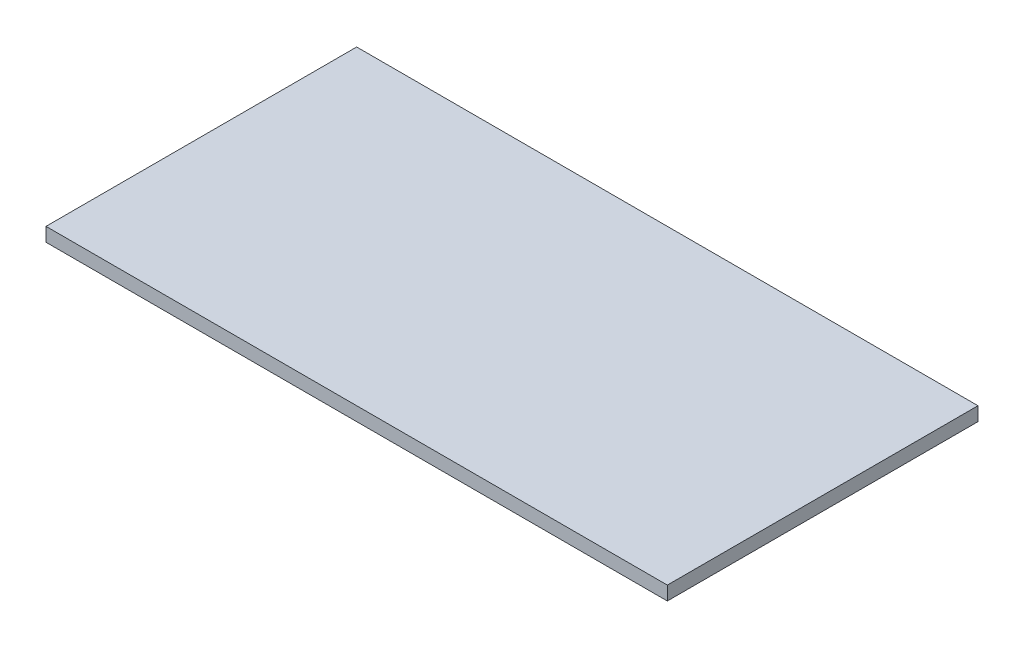
ISO-10303-21;
HEADER;
FILE_DESCRIPTION(('STEP AP214'),'2;1');
FILE_NAME('part.step','',(''),(''),'','','');
FILE_SCHEMA(('AUTOMOTIVE_DESIGN { 1 0 10303 214 1 1 1 1 }'));
ENDSEC;
DATA;
#1=APPLICATION_CONTEXT('core data for automotive mechanical design processes');
#2=APPLICATION_PROTOCOL_DEFINITION('international standard','automotive_design',2000,#1);
#3=PRODUCT_CONTEXT('',#1,'mechanical');
#4=PRODUCT('Part','Part','',(#3));
#5=PRODUCT_RELATED_PRODUCT_CATEGORY('part','',(#4));
#6=PRODUCT_DEFINITION_FORMATION('','',#4);
#7=PRODUCT_DEFINITION_CONTEXT('part definition',#1,'design');
#8=PRODUCT_DEFINITION('design','',#6,#7);
#9=PRODUCT_DEFINITION_SHAPE('','',#8);
#10=(LENGTH_UNIT() NAMED_UNIT(*) SI_UNIT(.MILLI.,.METRE.));
#11=(NAMED_UNIT(*) PLANE_ANGLE_UNIT() SI_UNIT($,.RADIAN.));
#12=(NAMED_UNIT(*) SI_UNIT($,.STERADIAN.) SOLID_ANGLE_UNIT());
#13=UNCERTAINTY_MEASURE_WITH_UNIT(LENGTH_MEASURE(1.E-05),#10,'distance_accuracy_value','');
#14=(GEOMETRIC_REPRESENTATION_CONTEXT(3) GLOBAL_UNCERTAINTY_ASSIGNED_CONTEXT((#13)) GLOBAL_UNIT_ASSIGNED_CONTEXT((#10,
#11,#12)) REPRESENTATION_CONTEXT('',''));
#15=CARTESIAN_POINT('',(0.,0.,0.));
#16=DIRECTION('',(0.,0.,1.));
#17=DIRECTION('',(1.,0.,0.));
#18=AXIS2_PLACEMENT_3D('',#15,#16,#17);
#19=CARTESIAN_POINT('',(90.,4.,-45.));
#20=DIRECTION('',(-1.,0.,0.));
#21=DIRECTION('',(0.,0.,1.));
#22=AXIS2_PLACEMENT_3D('',#19,#20,#21);
#23=PLANE('',#22);
#24=DIRECTION('',(0.,0.,-1.));
#25=VECTOR('',#24,1.);
#26=CARTESIAN_POINT('',(90.,0.,-45.));
#27=LINE('',#26,#25);
#28=CARTESIAN_POINT('',(90.,0.,45.));
#29=VERTEX_POINT('',#28);
#30=CARTESIAN_POINT('',(90.,0.,-45.));
#31=VERTEX_POINT('',#30);
#32=EDGE_CURVE('E99',#29,#31,#27,.T.);
#33=ORIENTED_EDGE('',*,*,#32,.T.);
#34=DIRECTION('',(0.,-1.,0.));
#35=VECTOR('',#34,1.);
#36=CARTESIAN_POINT('',(90.,4.,-45.));
#37=LINE('',#36,#35);
#38=CARTESIAN_POINT('',(90.,4.,-45.));
#39=VERTEX_POINT('',#38);
#40=EDGE_CURVE('E11',#39,#31,#37,.T.);
#41=ORIENTED_EDGE('',*,*,#40,.F.);
#42=DIRECTION('',(0.,0.,-1.));
#43=VECTOR('',#42,1.);
#44=CARTESIAN_POINT('',(90.,4.,-45.));
#45=LINE('',#44,#43);
#46=CARTESIAN_POINT('',(90.,4.,45.));
#47=VERTEX_POINT('',#46);
#48=EDGE_CURVE('E87',#47,#39,#45,.T.);
#49=ORIENTED_EDGE('',*,*,#48,.F.);
#50=DIRECTION('',(0.,-1.,0.));
#51=VECTOR('',#50,1.);
#52=CARTESIAN_POINT('',(90.,4.,45.));
#53=LINE('',#52,#51);
#54=EDGE_CURVE('E95',#47,#29,#53,.T.);
#55=ORIENTED_EDGE('',*,*,#54,.T.);
#56=EDGE_LOOP('',(#33,#41,#49,#55));
#57=FACE_BOUND('',#56,.T.);
#58=ADVANCED_FACE('F36',(#57),#23,.F.);
#59=CARTESIAN_POINT('',(-90.,4.,-45.));
#60=DIRECTION('',(0.,0.,1.));
#61=DIRECTION('',(1.,0.,0.));
#62=AXIS2_PLACEMENT_3D('',#59,#60,#61);
#63=PLANE('',#62);
#64=DIRECTION('',(-1.,0.,0.));
#65=VECTOR('',#64,1.);
#66=CARTESIAN_POINT('',(-90.,0.,-45.));
#67=LINE('',#66,#65);
#68=CARTESIAN_POINT('',(-90.,0.,-45.));
#69=VERTEX_POINT('',#68);
#70=EDGE_CURVE('E91',#31,#69,#67,.T.);
#71=ORIENTED_EDGE('',*,*,#70,.T.);
#72=DIRECTION('',(0.,-1.,0.));
#73=VECTOR('',#72,1.);
#74=CARTESIAN_POINT('',(-90.,4.,-45.));
#75=LINE('',#74,#73);
#76=CARTESIAN_POINT('',(-90.,4.,-45.));
#77=VERTEX_POINT('',#76);
#78=EDGE_CURVE('E44',#77,#69,#75,.T.);
#79=ORIENTED_EDGE('',*,*,#78,.F.);
#80=DIRECTION('',(-1.,0.,0.));
#81=VECTOR('',#80,1.);
#82=CARTESIAN_POINT('',(-90.,4.,-45.));
#83=LINE('',#82,#81);
#84=EDGE_CURVE('E82',#39,#77,#83,.T.);
#85=ORIENTED_EDGE('',*,*,#84,.F.);
#86=ORIENTED_EDGE('',*,*,#40,.T.);
#87=EDGE_LOOP('',(#71,#79,#85,#86));
#88=FACE_BOUND('',#87,.T.);
#89=ADVANCED_FACE('F90',(#88),#63,.F.);
#90=CARTESIAN_POINT('',(-90.,4.,-45.));
#91=DIRECTION('',(1.,0.,0.));
#92=DIRECTION('',(0.,0.,-1.));
#93=AXIS2_PLACEMENT_3D('',#90,#91,#92);
#94=PLANE('',#93);
#95=DIRECTION('',(0.,0.,1.));
#96=VECTOR('',#95,1.);
#97=CARTESIAN_POINT('',(-90.,0.,-45.));
#98=LINE('',#97,#96);
#99=CARTESIAN_POINT('',(-90.,0.,45.));
#100=VERTEX_POINT('',#99);
#101=EDGE_CURVE('E69',#69,#100,#98,.T.);
#102=ORIENTED_EDGE('',*,*,#101,.T.);
#103=DIRECTION('',(0.,-1.,0.));
#104=VECTOR('',#103,1.);
#105=CARTESIAN_POINT('',(-90.,4.,45.));
#106=LINE('',#105,#104);
#107=CARTESIAN_POINT('',(-90.,4.,45.));
#108=VERTEX_POINT('',#107);
#109=EDGE_CURVE('E92',#108,#100,#106,.T.);
#110=ORIENTED_EDGE('',*,*,#109,.F.);
#111=DIRECTION('',(0.,0.,1.));
#112=VECTOR('',#111,1.);
#113=CARTESIAN_POINT('',(-90.,4.,-45.));
#114=LINE('',#113,#112);
#115=EDGE_CURVE('E85',#77,#108,#114,.T.);
#116=ORIENTED_EDGE('',*,*,#115,.F.);
#117=ORIENTED_EDGE('',*,*,#78,.T.);
#118=EDGE_LOOP('',(#102,#110,#116,#117));
#119=FACE_BOUND('',#118,.T.);
#120=ADVANCED_FACE('F93',(#119),#94,.F.);
#121=CARTESIAN_POINT('',(-90.,4.,45.));
#122=DIRECTION('',(0.,0.,-1.));
#123=DIRECTION('',(-1.,0.,0.));
#124=AXIS2_PLACEMENT_3D('',#121,#122,#123);
#125=PLANE('',#124);
#126=DIRECTION('',(1.,0.,0.));
#127=VECTOR('',#126,1.);
#128=CARTESIAN_POINT('',(-90.,0.,45.));
#129=LINE('',#128,#127);
#130=EDGE_CURVE('E75',#100,#29,#129,.T.);
#131=ORIENTED_EDGE('',*,*,#130,.T.);
#132=ORIENTED_EDGE('',*,*,#54,.F.);
#133=DIRECTION('',(1.,0.,0.));
#134=VECTOR('',#133,1.);
#135=CARTESIAN_POINT('',(-90.,4.,45.));
#136=LINE('',#135,#134);
#137=EDGE_CURVE('E52',#108,#47,#136,.T.);
#138=ORIENTED_EDGE('',*,*,#137,.F.);
#139=ORIENTED_EDGE('',*,*,#109,.T.);
#140=EDGE_LOOP('',(#131,#132,#138,#139));
#141=FACE_BOUND('',#140,.T.);
#142=ADVANCED_FACE('F106',(#141),#125,.F.);
#143=CARTESIAN_POINT('',(0.,4.,0.));
#144=DIRECTION('',(0.,1.,0.));
#145=DIRECTION('',(0.,0.,1.));
#146=AXIS2_PLACEMENT_3D('',#143,#144,#145);
#147=PLANE('',#146);
#148=ORIENTED_EDGE('',*,*,#48,.T.);
#149=ORIENTED_EDGE('',*,*,#84,.T.);
#150=ORIENTED_EDGE('',*,*,#115,.T.);
#151=ORIENTED_EDGE('',*,*,#137,.T.);
#152=EDGE_LOOP('',(#148,#149,#150,#151));
#153=FACE_BOUND('',#152,.T.);
#154=ADVANCED_FACE('F83',(#153),#147,.T.);
#155=CARTESIAN_POINT('',(0.,0.,0.));
#156=DIRECTION('',(0.,1.,0.));
#157=DIRECTION('',(0.,0.,1.));
#158=AXIS2_PLACEMENT_3D('',#155,#156,#157);
#159=PLANE('',#158);
#160=ORIENTED_EDGE('',*,*,#32,.F.);
#161=ORIENTED_EDGE('',*,*,#130,.F.);
#162=ORIENTED_EDGE('',*,*,#101,.F.);
#163=ORIENTED_EDGE('',*,*,#70,.F.);
#164=EDGE_LOOP('',(#160,#161,#162,#163));
#165=FACE_BOUND('',#164,.T.);
#166=ADVANCED_FACE('F109',(#165),#159,.F.);
#167=CLOSED_SHELL('',(#58,#89,#120,#142,#154,#166));
#168=MANIFOLD_SOLID_BREP('B2',#167);
#169=ADVANCED_BREP_SHAPE_REPRESENTATION('',(#18,#168),#14);
#170=SHAPE_DEFINITION_REPRESENTATION(#9,#169);
ENDSEC;
END-ISO-10303-21;
